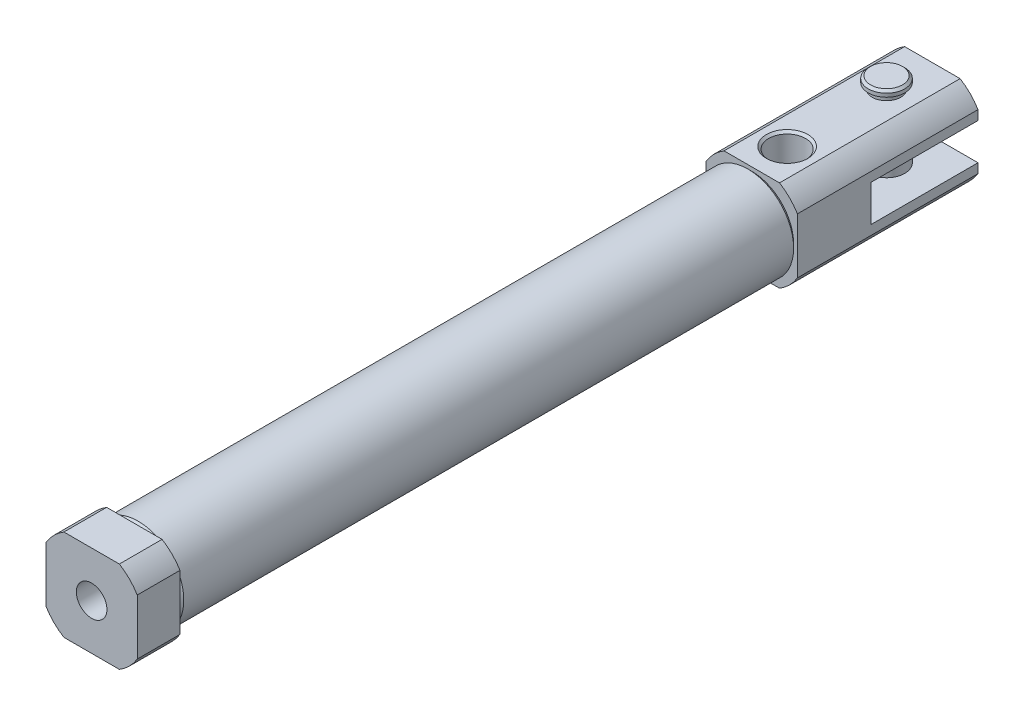
ISO-10303-21;
HEADER;
FILE_DESCRIPTION(('STEP AP214'),'2;1');
FILE_NAME('part.step','',(''),(''),'','','');
FILE_SCHEMA(('AUTOMOTIVE_DESIGN { 1 0 10303 214 1 1 1 1 }'));
ENDSEC;
DATA;
#1=APPLICATION_CONTEXT('core data for automotive mechanical design processes');
#2=APPLICATION_PROTOCOL_DEFINITION('international standard','automotive_design',2000,#1);
#3=PRODUCT_CONTEXT('',#1,'mechanical');
#4=PRODUCT('Part','Part','',(#3));
#5=PRODUCT_RELATED_PRODUCT_CATEGORY('part','',(#4));
#6=PRODUCT_DEFINITION_FORMATION('','',#4);
#7=PRODUCT_DEFINITION_CONTEXT('part definition',#1,'design');
#8=PRODUCT_DEFINITION('design','',#6,#7);
#9=PRODUCT_DEFINITION_SHAPE('','',#8);
#10=(LENGTH_UNIT() NAMED_UNIT(*) SI_UNIT(.MILLI.,.METRE.));
#11=(NAMED_UNIT(*) PLANE_ANGLE_UNIT() SI_UNIT($,.RADIAN.));
#12=(NAMED_UNIT(*) SI_UNIT($,.STERADIAN.) SOLID_ANGLE_UNIT());
#13=UNCERTAINTY_MEASURE_WITH_UNIT(LENGTH_MEASURE(1.E-05),#10,'distance_accuracy_value','');
#14=(GEOMETRIC_REPRESENTATION_CONTEXT(3) GLOBAL_UNCERTAINTY_ASSIGNED_CONTEXT((#13)) GLOBAL_UNIT_ASSIGNED_CONTEXT((#10,
#11,#12)) REPRESENTATION_CONTEXT('',''));
#15=CARTESIAN_POINT('',(0.,0.,0.));
#16=DIRECTION('',(0.,0.,1.));
#17=DIRECTION('',(1.,0.,0.));
#18=AXIS2_PLACEMENT_3D('',#15,#16,#17);
#19=CARTESIAN_POINT('',(0.,0.,-27.9));
#20=DIRECTION('',(0.,0.,1.));
#21=DIRECTION('',(1.,0.,0.));
#22=AXIS2_PLACEMENT_3D('',#19,#20,#21);
#23=PLANE('',#22);
#24=CARTESIAN_POINT('',(0.,0.,-27.9));
#25=DIRECTION('',(0.,0.,-1.));
#26=DIRECTION('',(-1.,0.,0.));
#27=AXIS2_PLACEMENT_3D('',#24,#25,#26);
#28=CIRCLE('',#27,5.);
#29=CARTESIAN_POINT('',(-5.,0.,-27.9));
#30=VERTEX_POINT('',#29);
#31=EDGE_CURVE('E20',#30,#30,#28,.F.);
#32=ORIENTED_EDGE('',*,*,#31,.T.);
#33=EDGE_LOOP('',(#32));
#34=FACE_BOUND('',#33,.T.);
#35=ADVANCED_FACE('F17',(#34),#23,.T.);
#36=CARTESIAN_POINT('',(0.,-7.493,-58.008));
#37=DIRECTION('',(0.,1.,0.));
#38=DIRECTION('',(0.,0.,1.));
#39=AXIS2_PLACEMENT_3D('',#36,#37,#38);
#40=PLANE('',#39);
#41=CARTESIAN_POINT('',(0.,-7.49299999995401,-58.008));
#42=DIRECTION('',(0.,1.,0.));
#43=DIRECTION('',(0.,0.,1.));
#44=AXIS2_PLACEMENT_3D('',#41,#42,#43);
#45=CIRCLE('',#44,2.08999999998032);
#46=CARTESIAN_POINT('',(0.,-7.49299999995401,-55.9180000000197));
#47=VERTEX_POINT('',#46);
#48=EDGE_CURVE('E204',#47,#47,#45,.T.);
#49=ORIENTED_EDGE('',*,*,#48,.F.);
#50=EDGE_LOOP('',(#49));
#51=FACE_BOUND('',#50,.T.);
#52=ADVANCED_FACE('F646',(#51),#40,.F.);
#53=CARTESIAN_POINT('',(0.,7.493,-58.008));
#54=DIRECTION('',(0.,1.,0.));
#55=DIRECTION('',(0.,0.,1.));
#56=AXIS2_PLACEMENT_3D('',#53,#54,#55);
#57=PLANE('',#56);
#58=CARTESIAN_POINT('',(0.,7.49299999995401,-58.008));
#59=DIRECTION('',(0.,-1.,0.));
#60=DIRECTION('',(0.,0.,-1.));
#61=AXIS2_PLACEMENT_3D('',#58,#59,#60);
#62=CIRCLE('',#61,2.09000000003907);
#63=CARTESIAN_POINT('',(0.,7.49299999995401,-60.0980000000391));
#64=VERTEX_POINT('',#63);
#65=EDGE_CURVE('E202',#64,#64,#62,.T.);
#66=ORIENTED_EDGE('',*,*,#65,.F.);
#67=EDGE_LOOP('',(#66));
#68=FACE_BOUND('',#67,.T.);
#69=ADVANCED_FACE('F216',(#68),#57,.T.);
#70=CARTESIAN_POINT('',(0.,0.,42.0421356237309));
#71=DIRECTION('',(0.,0.,-1.));
#72=DIRECTION('',(-1.,0.,0.));
#73=AXIS2_PLACEMENT_3D('',#70,#71,#72);
#74=CYLINDRICAL_SURFACE('',#73,5.);
#75=ORIENTED_EDGE('',*,*,#31,.F.);
#76=EDGE_LOOP('',(#75));
#77=FACE_BOUND('',#76,.T.);
#78=CARTESIAN_POINT('',(0.,0.,27.9));
#79=DIRECTION('',(0.,0.,-1.));
#80=DIRECTION('',(-1.,0.,0.));
#81=AXIS2_PLACEMENT_3D('',#78,#79,#80);
#82=CIRCLE('',#81,5.);
#83=CARTESIAN_POINT('',(-5.,0.,27.9));
#84=VERTEX_POINT('',#83);
#85=EDGE_CURVE('E198',#84,#84,#82,.F.);
#86=ORIENTED_EDGE('',*,*,#85,.T.);
#87=EDGE_LOOP('',(#86));
#88=FACE_BOUND('',#87,.T.);
#89=ADVANCED_FACE('F212',(#77,#88),#74,.F.);
#90=CARTESIAN_POINT('',(0.,-7.19300000008616,-58.008));
#91=DIRECTION('',(0.,1.,0.));
#92=DIRECTION('',(0.,0.,1.));
#93=AXIS2_PLACEMENT_3D('',#90,#91,#92);
#94=CONICAL_SURFACE('',#93,2.38999999984817,0.785398163397448);
#95=CARTESIAN_POINT('',(0.,-7.193,-58.008));
#96=DIRECTION('',(0.,-1.,0.));
#97=DIRECTION('',(0.,0.,-1.));
#98=AXIS2_PLACEMENT_3D('',#95,#96,#97);
#99=CIRCLE('',#98,2.39);
#100=CARTESIAN_POINT('',(0.,-7.193,-60.398));
#101=VERTEX_POINT('',#100);
#102=EDGE_CURVE('E201',#101,#101,#99,.F.);
#103=ORIENTED_EDGE('',*,*,#102,.F.);
#104=EDGE_LOOP('',(#103));
#105=FACE_BOUND('',#104,.T.);
#106=ORIENTED_EDGE('',*,*,#48,.T.);
#107=EDGE_LOOP('',(#106));
#108=FACE_BOUND('',#107,.T.);
#109=ADVANCED_FACE('F215',(#105,#108),#94,.T.);
#110=CARTESIAN_POINT('',(0.,7.19300000002931,-58.008));
#111=DIRECTION('',(0.,-1.,0.));
#112=DIRECTION('',(0.,0.,-1.));
#113=AXIS2_PLACEMENT_3D('',#110,#111,#112);
#114=CONICAL_SURFACE('',#113,2.3900000000206,0.785398163492187);
#115=CARTESIAN_POINT('',(0.,7.193,-58.008));
#116=DIRECTION('',(0.,-1.,0.));
#117=DIRECTION('',(0.,0.,-1.));
#118=AXIS2_PLACEMENT_3D('',#115,#116,#117);
#119=CIRCLE('',#118,2.39);
#120=CARTESIAN_POINT('',(0.,7.193,-60.398));
#121=VERTEX_POINT('',#120);
#122=EDGE_CURVE('E197',#121,#121,#119,.T.);
#123=ORIENTED_EDGE('',*,*,#122,.F.);
#124=EDGE_LOOP('',(#123));
#125=FACE_BOUND('',#124,.T.);
#126=ORIENTED_EDGE('',*,*,#65,.T.);
#127=EDGE_LOOP('',(#126));
#128=FACE_BOUND('',#127,.T.);
#129=ADVANCED_FACE('F224',(#125,#128),#114,.T.);
#130=CARTESIAN_POINT('',(0.,0.,27.9));
#131=DIRECTION('',(0.,0.,1.));
#132=DIRECTION('',(1.,0.,0.));
#133=AXIS2_PLACEMENT_3D('',#130,#131,#132);
#134=PLANE('',#133);
#135=ORIENTED_EDGE('',*,*,#85,.F.);
#136=EDGE_LOOP('',(#135));
#137=FACE_BOUND('',#136,.T.);
#138=CARTESIAN_POINT('',(0.,0.,27.9));
#139=DIRECTION('',(0.,0.,-1.));
#140=DIRECTION('',(-1.,0.,0.));
#141=AXIS2_PLACEMENT_3D('',#138,#139,#140);
#142=CIRCLE('',#141,2.);
#143=CARTESIAN_POINT('',(-2.,0.,27.9));
#144=VERTEX_POINT('',#143);
#145=EDGE_CURVE('E194',#144,#144,#142,.F.);
#146=ORIENTED_EDGE('',*,*,#145,.T.);
#147=EDGE_LOOP('',(#146));
#148=FACE_BOUND('',#147,.T.);
#149=ADVANCED_FACE('F220',(#137,#148),#134,.F.);
#150=CARTESIAN_POINT('',(0.,7.493,-58.008));
#151=DIRECTION('',(0.,-1.,0.));
#152=DIRECTION('',(0.,0.,-1.));
#153=AXIS2_PLACEMENT_3D('',#150,#151,#152);
#154=CYLINDRICAL_SURFACE('',#153,2.39);
#155=ORIENTED_EDGE('',*,*,#102,.T.);
#156=EDGE_LOOP('',(#155));
#157=FACE_BOUND('',#156,.T.);
#158=CARTESIAN_POINT('',(0.,-6.731,-58.008));
#159=DIRECTION('',(0.,-1.,0.));
#160=DIRECTION('',(0.,0.,-1.));
#161=AXIS2_PLACEMENT_3D('',#158,#159,#160);
#162=CIRCLE('',#161,2.39);
#163=CARTESIAN_POINT('',(0.,-6.731,-60.398));
#164=VERTEX_POINT('',#163);
#165=EDGE_CURVE('E191',#164,#164,#162,.T.);
#166=ORIENTED_EDGE('',*,*,#165,.T.);
#167=EDGE_LOOP('',(#166));
#168=FACE_BOUND('',#167,.T.);
#169=ADVANCED_FACE('F223',(#157,#168),#154,.T.);
#170=CARTESIAN_POINT('',(0.,0.,-45.008));
#171=DIRECTION('',(0.,-1.,0.));
#172=DIRECTION('',(0.,0.,-1.));
#173=AXIS2_PLACEMENT_3D('',#170,#171,#172);
#174=PLANE('',#173);
#175=CARTESIAN_POINT('',(0.,0.,-45.008));
#176=DIRECTION('',(0.,-1.,0.));
#177=DIRECTION('',(0.,0.,-1.));
#178=AXIS2_PLACEMENT_3D('',#175,#176,#177);
#179=CIRCLE('',#178,2.41500000000001);
#180=CARTESIAN_POINT('',(0.,0.,-47.423));
#181=VERTEX_POINT('',#180);
#182=EDGE_CURVE('E188',#181,#181,#179,.F.);
#183=ORIENTED_EDGE('',*,*,#182,.T.);
#184=EDGE_LOOP('',(#183));
#185=FACE_BOUND('',#184,.T.);
#186=ADVANCED_FACE('F242',(#185),#174,.F.);
#187=CARTESIAN_POINT('',(0.,7.493,-58.008));
#188=DIRECTION('',(0.,-1.,0.));
#189=DIRECTION('',(0.,0.,-1.));
#190=AXIS2_PLACEMENT_3D('',#187,#188,#189);
#191=CYLINDRICAL_SURFACE('',#190,2.39);
#192=CARTESIAN_POINT('',(0.,6.731,-58.008));
#193=DIRECTION('',(0.,-1.,0.));
#194=DIRECTION('',(0.,0.,-1.));
#195=AXIS2_PLACEMENT_3D('',#192,#193,#194);
#196=CIRCLE('',#195,2.39);
#197=CARTESIAN_POINT('',(0.,6.731,-60.398));
#198=VERTEX_POINT('',#197);
#199=EDGE_CURVE('E185',#198,#198,#196,.F.);
#200=ORIENTED_EDGE('',*,*,#199,.T.);
#201=EDGE_LOOP('',(#200));
#202=FACE_BOUND('',#201,.T.);
#203=ORIENTED_EDGE('',*,*,#122,.T.);
#204=EDGE_LOOP('',(#203));
#205=FACE_BOUND('',#204,.T.);
#206=ADVANCED_FACE('F231',(#202,#205),#191,.T.);
#207=CARTESIAN_POINT('',(0.,0.,45.974));
#208=DIRECTION('',(0.,0.,-1.));
#209=DIRECTION('',(-1.,0.,0.));
#210=AXIS2_PLACEMENT_3D('',#207,#208,#209);
#211=CYLINDRICAL_SURFACE('',#210,2.);
#212=CARTESIAN_POINT('',(0.,0.,45.974));
#213=DIRECTION('',(0.,0.,-1.));
#214=DIRECTION('',(-1.,0.,0.));
#215=AXIS2_PLACEMENT_3D('',#212,#213,#214);
#216=CIRCLE('',#215,2.);
#217=CARTESIAN_POINT('',(-2.,0.,45.974));
#218=VERTEX_POINT('',#217);
#219=EDGE_CURVE('E182',#218,#218,#216,.T.);
#220=ORIENTED_EDGE('',*,*,#219,.F.);
#221=EDGE_LOOP('',(#220));
#222=FACE_BOUND('',#221,.T.);
#223=ORIENTED_EDGE('',*,*,#145,.F.);
#224=EDGE_LOOP('',(#223));
#225=FACE_BOUND('',#224,.T.);
#226=ADVANCED_FACE('F228',(#222,#225),#211,.F.);
#227=CARTESIAN_POINT('',(0.,-6.731,-60.398));
#228=DIRECTION('',(0.,-1.,0.));
#229=DIRECTION('',(0.,0.,-1.));
#230=AXIS2_PLACEMENT_3D('',#227,#228,#229);
#231=PLANE('',#230);
#232=CARTESIAN_POINT('',(0.,-6.731,-58.008));
#233=DIRECTION('',(0.,-1.,0.));
#234=DIRECTION('',(0.,0.,-1.));
#235=AXIS2_PLACEMENT_3D('',#232,#233,#234);
#236=CIRCLE('',#235,1.8669);
#237=CARTESIAN_POINT('',(0.,-6.731,-59.8749));
#238=VERTEX_POINT('',#237);
#239=EDGE_CURVE('E179',#238,#238,#236,.F.);
#240=ORIENTED_EDGE('',*,*,#239,.F.);
#241=EDGE_LOOP('',(#240));
#242=FACE_BOUND('',#241,.T.);
#243=ORIENTED_EDGE('',*,*,#165,.F.);
#244=EDGE_LOOP('',(#243));
#245=FACE_BOUND('',#244,.T.);
#246=ADVANCED_FACE('F230',(#242,#245),#231,.F.);
#247=CARTESIAN_POINT('',(0.,0.,-45.008));
#248=DIRECTION('',(0.,-1.,0.));
#249=DIRECTION('',(0.,0.,-1.));
#250=AXIS2_PLACEMENT_3D('',#247,#248,#249);
#251=CYLINDRICAL_SURFACE('',#250,2.41500000000001);
#252=ORIENTED_EDGE('',*,*,#182,.F.);
#253=EDGE_LOOP('',(#252));
#254=FACE_BOUND('',#253,.T.);
#255=CARTESIAN_POINT('',(0.,5.66900000001169,-45.008));
#256=DIRECTION('',(0.,1.,0.));
#257=DIRECTION('',(0.,0.,1.));
#258=AXIS2_PLACEMENT_3D('',#255,#256,#257);
#259=CIRCLE('',#258,2.4149999999324);
#260=CARTESIAN_POINT('',(0.,5.66900000001169,-42.5930000000676));
#261=VERTEX_POINT('',#260);
#262=EDGE_CURVE('E178',#261,#261,#259,.T.);
#263=ORIENTED_EDGE('',*,*,#262,.T.);
#264=EDGE_LOOP('',(#263));
#265=FACE_BOUND('',#264,.T.);
#266=ADVANCED_FACE('F239',(#254,#265),#251,.F.);
#267=CARTESIAN_POINT('',(0.,6.731,-60.398));
#268=DIRECTION('',(0.,1.,0.));
#269=DIRECTION('',(0.,0.,1.));
#270=AXIS2_PLACEMENT_3D('',#267,#268,#269);
#271=PLANE('',#270);
#272=ORIENTED_EDGE('',*,*,#199,.F.);
#273=EDGE_LOOP('',(#272));
#274=FACE_BOUND('',#273,.T.);
#275=CARTESIAN_POINT('',(0.,6.731,-58.008));
#276=DIRECTION('',(0.,-1.,0.));
#277=DIRECTION('',(0.,0.,-1.));
#278=AXIS2_PLACEMENT_3D('',#275,#276,#277);
#279=CIRCLE('',#278,1.8669);
#280=CARTESIAN_POINT('',(0.,6.731,-59.8749));
#281=VERTEX_POINT('',#280);
#282=EDGE_CURVE('E174',#281,#281,#279,.T.);
#283=ORIENTED_EDGE('',*,*,#282,.F.);
#284=EDGE_LOOP('',(#283));
#285=FACE_BOUND('',#284,.T.);
#286=ADVANCED_FACE('F367',(#274,#285),#271,.F.);
#287=CARTESIAN_POINT('',(0.,7.493,-58.008));
#288=DIRECTION('',(0.,-1.,0.));
#289=DIRECTION('',(0.,0.,-1.));
#290=AXIS2_PLACEMENT_3D('',#287,#288,#289);
#291=CYLINDRICAL_SURFACE('',#290,2.39);
#292=CARTESIAN_POINT('',(0.,2.39,-58.008));
#293=DIRECTION('',(0.,-1.,0.));
#294=DIRECTION('',(0.,0.,-1.));
#295=AXIS2_PLACEMENT_3D('',#292,#293,#294);
#296=CIRCLE('',#295,2.39);
#297=CARTESIAN_POINT('',(0.,2.39,-60.398));
#298=VERTEX_POINT('',#297);
#299=EDGE_CURVE('E169',#298,#298,#296,.T.);
#300=ORIENTED_EDGE('',*,*,#299,.T.);
#301=EDGE_LOOP('',(#300));
#302=FACE_BOUND('',#301,.T.);
#303=CARTESIAN_POINT('',(0.,-2.39,-58.008));
#304=DIRECTION('',(0.,-1.,0.));
#305=DIRECTION('',(0.,0.,-1.));
#306=AXIS2_PLACEMENT_3D('',#303,#304,#305);
#307=CIRCLE('',#306,2.39);
#308=CARTESIAN_POINT('',(0.,-2.39,-60.398));
#309=VERTEX_POINT('',#308);
#310=EDGE_CURVE('E165',#309,#309,#307,.F.);
#311=ORIENTED_EDGE('',*,*,#310,.T.);
#312=EDGE_LOOP('',(#311));
#313=FACE_BOUND('',#312,.T.);
#314=ADVANCED_FACE('F363',(#302,#313),#291,.T.);
#315=CARTESIAN_POINT('',(0.,0.,45.974));
#316=DIRECTION('',(0.,0.,1.));
#317=DIRECTION('',(1.,0.,0.));
#318=AXIS2_PLACEMENT_3D('',#315,#316,#317);
#319=PLANE('',#318);
#320=ORIENTED_EDGE('',*,*,#219,.T.);
#321=EDGE_LOOP('',(#320));
#322=FACE_BOUND('',#321,.T.);
#323=CARTESIAN_POINT('',(0.,0.,45.974));
#324=DIRECTION('',(0.,0.,-1.));
#325=DIRECTION('',(-1.,0.,0.));
#326=AXIS2_PLACEMENT_3D('',#323,#324,#325);
#327=CIRCLE('',#326,6.985);
#328=CARTESIAN_POINT('',(-5.969,3.62784564169977,45.974));
#329=VERTEX_POINT('',#328);
#330=CARTESIAN_POINT('',(-3.62784564169977,5.969,45.974));
#331=VERTEX_POINT('',#330);
#332=EDGE_CURVE('E451',#329,#331,#327,.T.);
#333=ORIENTED_EDGE('',*,*,#332,.F.);
#334=DIRECTION('',(0.,1.,0.));
#335=VECTOR('',#334,1.);
#336=CARTESIAN_POINT('',(-5.969,3.62784564169977,45.974));
#337=LINE('',#336,#335);
#338=CARTESIAN_POINT('',(-5.969,-3.62784564169977,45.974));
#339=VERTEX_POINT('',#338);
#340=EDGE_CURVE('E466',#329,#339,#337,.F.);
#341=ORIENTED_EDGE('',*,*,#340,.T.);
#342=CARTESIAN_POINT('',(0.,0.,45.974));
#343=DIRECTION('',(0.,0.,-1.));
#344=DIRECTION('',(-1.,0.,0.));
#345=AXIS2_PLACEMENT_3D('',#342,#343,#344);
#346=CIRCLE('',#345,6.985);
#347=CARTESIAN_POINT('',(-3.62784564169977,-5.969,45.974));
#348=VERTEX_POINT('',#347);
#349=EDGE_CURVE('E143',#348,#339,#346,.T.);
#350=ORIENTED_EDGE('',*,*,#349,.F.);
#351=DIRECTION('',(1.,0.,0.));
#352=VECTOR('',#351,1.);
#353=CARTESIAN_POINT('',(-3.62784564169977,-5.969,45.974));
#354=LINE('',#353,#352);
#355=CARTESIAN_POINT('',(3.62784564169977,-5.969,45.974));
#356=VERTEX_POINT('',#355);
#357=EDGE_CURVE('E139',#348,#356,#354,.T.);
#358=ORIENTED_EDGE('',*,*,#357,.T.);
#359=CARTESIAN_POINT('',(0.,0.,45.974));
#360=DIRECTION('',(0.,0.,-1.));
#361=DIRECTION('',(-1.,0.,0.));
#362=AXIS2_PLACEMENT_3D('',#359,#360,#361);
#363=CIRCLE('',#362,6.985);
#364=CARTESIAN_POINT('',(5.969,-3.62784564169977,45.974));
#365=VERTEX_POINT('',#364);
#366=EDGE_CURVE('E136',#365,#356,#363,.T.);
#367=ORIENTED_EDGE('',*,*,#366,.F.);
#368=DIRECTION('',(0.,1.,0.));
#369=VECTOR('',#368,1.);
#370=CARTESIAN_POINT('',(5.969,3.62784564169977,45.974));
#371=LINE('',#370,#369);
#372=CARTESIAN_POINT('',(5.969,3.62784564169977,45.974));
#373=VERTEX_POINT('',#372);
#374=EDGE_CURVE('E384',#365,#373,#371,.T.);
#375=ORIENTED_EDGE('',*,*,#374,.T.);
#376=CARTESIAN_POINT('',(0.,0.,45.974));
#377=DIRECTION('',(0.,0.,-1.));
#378=DIRECTION('',(-1.,0.,0.));
#379=AXIS2_PLACEMENT_3D('',#376,#377,#378);
#380=CIRCLE('',#379,6.985);
#381=CARTESIAN_POINT('',(3.62784564169977,5.969,45.974));
#382=VERTEX_POINT('',#381);
#383=EDGE_CURVE('E163',#382,#373,#380,.T.);
#384=ORIENTED_EDGE('',*,*,#383,.F.);
#385=DIRECTION('',(1.,0.,0.));
#386=VECTOR('',#385,1.);
#387=CARTESIAN_POINT('',(-3.62784564169977,5.969,45.974));
#388=LINE('',#387,#386);
#389=EDGE_CURVE('E454',#382,#331,#388,.F.);
#390=ORIENTED_EDGE('',*,*,#389,.T.);
#391=EDGE_LOOP('',(#333,#341,#350,#358,#367,#375,#384,#390));
#392=FACE_BOUND('',#391,.T.);
#393=ADVANCED_FACE('F141',(#322,#392),#319,.T.);
#394=CARTESIAN_POINT('',(0.,0.,-58.008));
#395=DIRECTION('',(0.,-1.,0.));
#396=DIRECTION('',(0.,0.,-1.));
#397=AXIS2_PLACEMENT_3D('',#394,#395,#396);
#398=CYLINDRICAL_SURFACE('',#397,1.8669);
#399=ORIENTED_EDGE('',*,*,#239,.T.);
#400=EDGE_LOOP('',(#399));
#401=FACE_BOUND('',#400,.T.);
#402=CARTESIAN_POINT('',(0.,-5.969,-58.008));
#403=DIRECTION('',(0.,-1.,0.));
#404=DIRECTION('',(0.,0.,-1.));
#405=AXIS2_PLACEMENT_3D('',#402,#403,#404);
#406=CIRCLE('',#405,1.8669);
#407=CARTESIAN_POINT('',(0.,-5.969,-59.8749));
#408=VERTEX_POINT('',#407);
#409=EDGE_CURVE('E445',#408,#408,#406,.T.);
#410=ORIENTED_EDGE('',*,*,#409,.T.);
#411=EDGE_LOOP('',(#410));
#412=FACE_BOUND('',#411,.T.);
#413=ADVANCED_FACE('F356',(#401,#412),#398,.T.);
#414=CARTESIAN_POINT('',(0.,5.96900000005007,-45.008));
#415=DIRECTION('',(0.,1.,0.));
#416=DIRECTION('',(0.,0.,1.));
#417=AXIS2_PLACEMENT_3D('',#414,#415,#416);
#418=CONICAL_SURFACE('',#417,2.71500000002762,0.785398163397448);
#419=CARTESIAN_POINT('',(0.,5.96900000005007,-45.008));
#420=DIRECTION('',(0.,1.,0.));
#421=DIRECTION('',(0.,0.,1.));
#422=AXIS2_PLACEMENT_3D('',#419,#420,#421);
#423=CIRCLE('',#422,2.71500000002762);
#424=CARTESIAN_POINT('',(0.,5.96900000005007,-42.2929999999724));
#425=VERTEX_POINT('',#424);
#426=EDGE_CURVE('E432',#425,#425,#423,.T.);
#427=ORIENTED_EDGE('',*,*,#426,.T.);
#428=EDGE_LOOP('',(#427));
#429=FACE_BOUND('',#428,.T.);
#430=ORIENTED_EDGE('',*,*,#262,.F.);
#431=EDGE_LOOP('',(#430));
#432=FACE_BOUND('',#431,.T.);
#433=ADVANCED_FACE('F352',(#429,#432),#418,.F.);
#434=CARTESIAN_POINT('',(0.,0.,-58.008));
#435=DIRECTION('',(0.,-1.,0.));
#436=DIRECTION('',(0.,0.,-1.));
#437=AXIS2_PLACEMENT_3D('',#434,#435,#436);
#438=CYLINDRICAL_SURFACE('',#437,1.8669);
#439=CARTESIAN_POINT('',(0.,5.969,-58.008));
#440=DIRECTION('',(0.,-1.,0.));
#441=DIRECTION('',(0.,0.,-1.));
#442=AXIS2_PLACEMENT_3D('',#439,#440,#441);
#443=CIRCLE('',#442,1.8669);
#444=CARTESIAN_POINT('',(0.,5.969,-59.8749));
#445=VERTEX_POINT('',#444);
#446=EDGE_CURVE('E429',#445,#445,#443,.F.);
#447=ORIENTED_EDGE('',*,*,#446,.T.);
#448=EDGE_LOOP('',(#447));
#449=FACE_BOUND('',#448,.T.);
#450=ORIENTED_EDGE('',*,*,#282,.T.);
#451=EDGE_LOOP('',(#450));
#452=FACE_BOUND('',#451,.T.);
#453=ADVANCED_FACE('F348',(#449,#452),#438,.T.);
#454=CARTESIAN_POINT('',(0.,0.,-64.008));
#455=DIRECTION('',(0.,0.,-1.));
#456=DIRECTION('',(-1.,0.,0.));
#457=AXIS2_PLACEMENT_3D('',#454,#455,#456);
#458=PLANE('',#457);
#459=CARTESIAN_POINT('',(0.,0.,-64.008));
#460=DIRECTION('',(0.,0.,1.));
#461=DIRECTION('',(1.,0.,0.));
#462=AXIS2_PLACEMENT_3D('',#459,#460,#461);
#463=CIRCLE('',#462,6.985);
#464=CARTESIAN_POINT('',(5.969,3.62784564169977,-64.008));
#465=VERTEX_POINT('',#464);
#466=CARTESIAN_POINT('',(3.62784564169977,5.969,-64.008));
#467=VERTEX_POINT('',#466);
#468=EDGE_CURVE('E425',#465,#467,#463,.T.);
#469=ORIENTED_EDGE('',*,*,#468,.F.);
#470=DIRECTION('',(0.,1.,0.));
#471=VECTOR('',#470,1.);
#472=CARTESIAN_POINT('',(5.969,0.,-64.008));
#473=LINE('',#472,#471);
#474=CARTESIAN_POINT('',(5.969,2.39,-64.008));
#475=VERTEX_POINT('',#474);
#476=EDGE_CURVE('E177',#465,#475,#473,.F.);
#477=ORIENTED_EDGE('',*,*,#476,.T.);
#478=DIRECTION('',(1.,0.,0.));
#479=VECTOR('',#478,1.);
#480=CARTESIAN_POINT('',(-5.97,2.39,-64.008));
#481=LINE('',#480,#479);
#482=CARTESIAN_POINT('',(-5.969,2.39,-64.008));
#483=VERTEX_POINT('',#482);
#484=EDGE_CURVE('E173',#475,#483,#481,.F.);
#485=ORIENTED_EDGE('',*,*,#484,.T.);
#486=DIRECTION('',(0.,1.,0.));
#487=VECTOR('',#486,1.);
#488=CARTESIAN_POINT('',(-5.969,3.62784564169977,-64.008));
#489=LINE('',#488,#487);
#490=CARTESIAN_POINT('',(-5.969,3.62784564169977,-64.008));
#491=VERTEX_POINT('',#490);
#492=EDGE_CURVE('E478',#483,#491,#489,.T.);
#493=ORIENTED_EDGE('',*,*,#492,.T.);
#494=CARTESIAN_POINT('',(0.,0.,-64.008));
#495=DIRECTION('',(0.,0.,1.));
#496=DIRECTION('',(1.,0.,0.));
#497=AXIS2_PLACEMENT_3D('',#494,#495,#496);
#498=CIRCLE('',#497,6.985);
#499=CARTESIAN_POINT('',(-3.62784564169977,5.969,-64.008));
#500=VERTEX_POINT('',#499);
#501=EDGE_CURVE('E436',#500,#491,#498,.T.);
#502=ORIENTED_EDGE('',*,*,#501,.F.);
#503=DIRECTION('',(1.,0.,0.));
#504=VECTOR('',#503,1.);
#505=CARTESIAN_POINT('',(3.62784564169977,5.969,-64.008));
#506=LINE('',#505,#504);
#507=EDGE_CURVE('E435',#500,#467,#506,.T.);
#508=ORIENTED_EDGE('',*,*,#507,.T.);
#509=EDGE_LOOP('',(#469,#477,#485,#493,#502,#508));
#510=FACE_BOUND('',#509,.T.);
#511=ADVANCED_FACE('F344',(#510),#458,.T.);
#512=CARTESIAN_POINT('',(-5.97,2.39,-64.008));
#513=DIRECTION('',(0.,1.,0.));
#514=DIRECTION('',(0.,0.,1.));
#515=AXIS2_PLACEMENT_3D('',#512,#513,#514);
#516=PLANE('',#515);
#517=ORIENTED_EDGE('',*,*,#299,.F.);
#518=EDGE_LOOP('',(#517));
#519=FACE_BOUND('',#518,.T.);
#520=DIRECTION('',(0.,0.,1.));
#521=VECTOR('',#520,1.);
#522=CARTESIAN_POINT('',(5.969,2.39,-64.008));
#523=LINE('',#522,#521);
#524=CARTESIAN_POINT('',(5.969,2.39,-50.008));
#525=VERTEX_POINT('',#524);
#526=EDGE_CURVE('E504',#475,#525,#523,.T.);
#527=ORIENTED_EDGE('',*,*,#526,.T.);
#528=DIRECTION('',(1.,0.,0.));
#529=VECTOR('',#528,1.);
#530=CARTESIAN_POINT('',(-5.97,2.39,-50.008));
#531=LINE('',#530,#529);
#532=CARTESIAN_POINT('',(-5.969,2.39,-50.008));
#533=VERTEX_POINT('',#532);
#534=EDGE_CURVE('E172',#525,#533,#531,.F.);
#535=ORIENTED_EDGE('',*,*,#534,.T.);
#536=DIRECTION('',(0.,0.,1.));
#537=VECTOR('',#536,1.);
#538=CARTESIAN_POINT('',(-5.969,2.39,-64.008));
#539=LINE('',#538,#537);
#540=EDGE_CURVE('E475',#533,#483,#539,.F.);
#541=ORIENTED_EDGE('',*,*,#540,.T.);
#542=ORIENTED_EDGE('',*,*,#484,.F.);
#543=EDGE_LOOP('',(#527,#535,#541,#542));
#544=FACE_BOUND('',#543,.T.);
#545=ADVANCED_FACE('F340',(#519,#544),#516,.F.);
#546=CARTESIAN_POINT('',(-5.97,2.39,-50.008));
#547=DIRECTION('',(0.,0.,1.));
#548=DIRECTION('',(1.,0.,0.));
#549=AXIS2_PLACEMENT_3D('',#546,#547,#548);
#550=PLANE('',#549);
#551=DIRECTION('',(0.,-1.,0.));
#552=VECTOR('',#551,1.);
#553=CARTESIAN_POINT('',(5.969,3.62784564169977,-50.008));
#554=LINE('',#553,#552);
#555=CARTESIAN_POINT('',(5.969,-2.39,-50.008));
#556=VERTEX_POINT('',#555);
#557=EDGE_CURVE('E507',#525,#556,#554,.T.);
#558=ORIENTED_EDGE('',*,*,#557,.T.);
#559=DIRECTION('',(1.,0.,0.));
#560=VECTOR('',#559,1.);
#561=CARTESIAN_POINT('',(-5.97,-2.39,-50.008));
#562=LINE('',#561,#560);
#563=CARTESIAN_POINT('',(-5.969,-2.39,-50.008));
#564=VERTEX_POINT('',#563);
#565=EDGE_CURVE('E168',#556,#564,#562,.F.);
#566=ORIENTED_EDGE('',*,*,#565,.T.);
#567=DIRECTION('',(0.,1.,0.));
#568=VECTOR('',#567,1.);
#569=CARTESIAN_POINT('',(-5.969,3.62784564169977,-50.008));
#570=LINE('',#569,#568);
#571=EDGE_CURVE('E440',#564,#533,#570,.T.);
#572=ORIENTED_EDGE('',*,*,#571,.T.);
#573=ORIENTED_EDGE('',*,*,#534,.F.);
#574=EDGE_LOOP('',(#558,#566,#572,#573));
#575=FACE_BOUND('',#574,.T.);
#576=ADVANCED_FACE('F336',(#575),#550,.F.);
#577=CARTESIAN_POINT('',(-5.97,-2.39,-64.008));
#578=DIRECTION('',(0.,-1.,0.));
#579=DIRECTION('',(0.,0.,-1.));
#580=AXIS2_PLACEMENT_3D('',#577,#578,#579);
#581=PLANE('',#580);
#582=ORIENTED_EDGE('',*,*,#310,.F.);
#583=EDGE_LOOP('',(#582));
#584=FACE_BOUND('',#583,.T.);
#585=DIRECTION('',(0.,0.,1.));
#586=VECTOR('',#585,1.);
#587=CARTESIAN_POINT('',(5.969,-2.39,-64.008));
#588=LINE('',#587,#586);
#589=CARTESIAN_POINT('',(5.969,-2.39,-64.008));
#590=VERTEX_POINT('',#589);
#591=EDGE_CURVE('E517',#556,#590,#588,.F.);
#592=ORIENTED_EDGE('',*,*,#591,.T.);
#593=DIRECTION('',(-1.,0.,0.));
#594=VECTOR('',#593,1.);
#595=CARTESIAN_POINT('',(0.,-2.39,-64.008));
#596=LINE('',#595,#594);
#597=CARTESIAN_POINT('',(-5.969,-2.39,-64.008));
#598=VERTEX_POINT('',#597);
#599=EDGE_CURVE('E146',#598,#590,#596,.F.);
#600=ORIENTED_EDGE('',*,*,#599,.F.);
#601=DIRECTION('',(0.,0.,1.));
#602=VECTOR('',#601,1.);
#603=CARTESIAN_POINT('',(-5.969,-2.39,-64.008));
#604=LINE('',#603,#602);
#605=EDGE_CURVE('E472',#598,#564,#604,.T.);
#606=ORIENTED_EDGE('',*,*,#605,.T.);
#607=ORIENTED_EDGE('',*,*,#565,.F.);
#608=EDGE_LOOP('',(#592,#600,#606,#607));
#609=FACE_BOUND('',#608,.T.);
#610=ADVANCED_FACE('F332',(#584,#609),#581,.F.);
#611=CARTESIAN_POINT('',(0.,0.,-64.008));
#612=DIRECTION('',(0.,0.,-1.));
#613=DIRECTION('',(-1.,0.,0.));
#614=AXIS2_PLACEMENT_3D('',#611,#612,#613);
#615=PLANE('',#614);
#616=CARTESIAN_POINT('',(0.,0.,-64.008));
#617=DIRECTION('',(0.,0.,1.));
#618=DIRECTION('',(1.,0.,0.));
#619=AXIS2_PLACEMENT_3D('',#616,#617,#618);
#620=CIRCLE('',#619,6.985);
#621=CARTESIAN_POINT('',(-5.969,-3.62784564169977,-64.008));
#622=VERTEX_POINT('',#621);
#623=CARTESIAN_POINT('',(-3.62784564169977,-5.969,-64.008));
#624=VERTEX_POINT('',#623);
#625=EDGE_CURVE('E441',#622,#624,#620,.T.);
#626=ORIENTED_EDGE('',*,*,#625,.F.);
#627=DIRECTION('',(0.,1.,0.));
#628=VECTOR('',#627,1.);
#629=CARTESIAN_POINT('',(-5.969,3.62784564169977,-64.008));
#630=LINE('',#629,#628);
#631=EDGE_CURVE('E483',#622,#598,#630,.T.);
#632=ORIENTED_EDGE('',*,*,#631,.T.);
#633=ORIENTED_EDGE('',*,*,#599,.T.);
#634=DIRECTION('',(0.,-1.,0.));
#635=VECTOR('',#634,1.);
#636=CARTESIAN_POINT('',(5.969,3.62784564169977,-64.008));
#637=LINE('',#636,#635);
#638=CARTESIAN_POINT('',(5.969,-3.62784564169977,-64.008));
#639=VERTEX_POINT('',#638);
#640=EDGE_CURVE('E526',#590,#639,#637,.T.);
#641=ORIENTED_EDGE('',*,*,#640,.T.);
#642=CARTESIAN_POINT('',(0.,0.,-64.008));
#643=DIRECTION('',(0.,0.,1.));
#644=DIRECTION('',(1.,0.,0.));
#645=AXIS2_PLACEMENT_3D('',#642,#643,#644);
#646=CIRCLE('',#645,6.985);
#647=CARTESIAN_POINT('',(3.62784564169977,-5.969,-64.008));
#648=VERTEX_POINT('',#647);
#649=EDGE_CURVE('E420',#648,#639,#646,.T.);
#650=ORIENTED_EDGE('',*,*,#649,.F.);
#651=DIRECTION('',(1.,0.,0.));
#652=VECTOR('',#651,1.);
#653=CARTESIAN_POINT('',(3.62784564169977,-5.969,-64.008));
#654=LINE('',#653,#652);
#655=EDGE_CURVE('E448',#648,#624,#654,.F.);
#656=ORIENTED_EDGE('',*,*,#655,.T.);
#657=EDGE_LOOP('',(#626,#632,#633,#641,#650,#656));
#658=FACE_BOUND('',#657,.T.);
#659=ADVANCED_FACE('F329',(#658),#615,.T.);
#660=CARTESIAN_POINT('',(-3.62784564169977,-5.969,45.974));
#661=DIRECTION('',(0.,1.,0.));
#662=DIRECTION('',(0.,0.,1.));
#663=AXIS2_PLACEMENT_3D('',#660,#661,#662);
#664=PLANE('',#663);
#665=DIRECTION('',(0.,0.,-1.));
#666=VECTOR('',#665,1.);
#667=CARTESIAN_POINT('',(3.62784564169977,-5.969,45.974));
#668=LINE('',#667,#666);
#669=CARTESIAN_POINT('',(3.62784564169977,-5.969,40.386));
#670=VERTEX_POINT('',#669);
#671=EDGE_CURVE('E149',#356,#670,#668,.T.);
#672=ORIENTED_EDGE('',*,*,#671,.F.);
#673=ORIENTED_EDGE('',*,*,#357,.F.);
#674=DIRECTION('',(0.,0.,-1.));
#675=VECTOR('',#674,1.);
#676=CARTESIAN_POINT('',(-3.62784564169977,-5.969,45.974));
#677=LINE('',#676,#675);
#678=CARTESIAN_POINT('',(-3.62784564169977,-5.969,40.386));
#679=VERTEX_POINT('',#678);
#680=EDGE_CURVE('E450',#679,#348,#677,.F.);
#681=ORIENTED_EDGE('',*,*,#680,.F.);
#682=DIRECTION('',(1.,0.,0.));
#683=VECTOR('',#682,1.);
#684=CARTESIAN_POINT('',(0.,-5.969,40.386));
#685=LINE('',#684,#683);
#686=EDGE_CURVE('E152',#679,#670,#685,.T.);
#687=ORIENTED_EDGE('',*,*,#686,.T.);
#688=EDGE_LOOP('',(#672,#673,#681,#687));
#689=FACE_BOUND('',#688,.T.);
#690=ADVANCED_FACE('F150',(#689),#664,.F.);
#691=CARTESIAN_POINT('',(0.,0.,45.974));
#692=DIRECTION('',(0.,0.,-1.));
#693=DIRECTION('',(-1.,0.,0.));
#694=AXIS2_PLACEMENT_3D('',#691,#692,#693);
#695=CYLINDRICAL_SURFACE('',#694,6.985);
#696=ORIENTED_EDGE('',*,*,#366,.T.);
#697=ORIENTED_EDGE('',*,*,#671,.T.);
#698=CARTESIAN_POINT('',(0.,0.,40.386));
#699=DIRECTION('',(0.,0.,-1.));
#700=DIRECTION('',(-1.,0.,0.));
#701=AXIS2_PLACEMENT_3D('',#698,#699,#700);
#702=CIRCLE('',#701,6.985);
#703=CARTESIAN_POINT('',(5.969,-3.62784564169977,40.386));
#704=VERTEX_POINT('',#703);
#705=EDGE_CURVE('E418',#670,#704,#702,.F.);
#706=ORIENTED_EDGE('',*,*,#705,.T.);
#707=DIRECTION('',(0.,0.,1.));
#708=VECTOR('',#707,1.);
#709=CARTESIAN_POINT('',(5.969,-3.62784564169977,45.974));
#710=LINE('',#709,#708);
#711=EDGE_CURVE('E155',#704,#365,#710,.T.);
#712=ORIENTED_EDGE('',*,*,#711,.T.);
#713=EDGE_LOOP('',(#696,#697,#706,#712));
#714=FACE_BOUND('',#713,.T.);
#715=ADVANCED_FACE('F157',(#714),#695,.T.);
#716=CARTESIAN_POINT('',(5.969,3.62784564169977,45.974));
#717=DIRECTION('',(-1.,0.,0.));
#718=DIRECTION('',(0.,0.,1.));
#719=AXIS2_PLACEMENT_3D('',#716,#717,#718);
#720=PLANE('',#719);
#721=DIRECTION('',(0.,0.,-1.));
#722=VECTOR('',#721,1.);
#723=CARTESIAN_POINT('',(5.969,3.62784564169977,45.974));
#724=LINE('',#723,#722);
#725=CARTESIAN_POINT('',(5.969,3.62784564169977,40.386));
#726=VERTEX_POINT('',#725);
#727=EDGE_CURVE('E463',#373,#726,#724,.T.);
#728=ORIENTED_EDGE('',*,*,#727,.F.);
#729=ORIENTED_EDGE('',*,*,#374,.F.);
#730=ORIENTED_EDGE('',*,*,#711,.F.);
#731=DIRECTION('',(0.,1.,0.));
#732=VECTOR('',#731,1.);
#733=CARTESIAN_POINT('',(5.969,0.,40.386));
#734=LINE('',#733,#732);
#735=EDGE_CURVE('E417',#704,#726,#734,.T.);
#736=ORIENTED_EDGE('',*,*,#735,.T.);
#737=EDGE_LOOP('',(#728,#729,#730,#736));
#738=FACE_BOUND('',#737,.T.);
#739=ADVANCED_FACE('F320',(#738),#720,.F.);
#740=CARTESIAN_POINT('',(0.,0.,45.974));
#741=DIRECTION('',(0.,0.,-1.));
#742=DIRECTION('',(-1.,0.,0.));
#743=AXIS2_PLACEMENT_3D('',#740,#741,#742);
#744=CYLINDRICAL_SURFACE('',#743,6.985);
#745=ORIENTED_EDGE('',*,*,#383,.T.);
#746=ORIENTED_EDGE('',*,*,#727,.T.);
#747=CARTESIAN_POINT('',(0.,0.,40.386));
#748=DIRECTION('',(0.,0.,-1.));
#749=DIRECTION('',(-1.,0.,0.));
#750=AXIS2_PLACEMENT_3D('',#747,#748,#749);
#751=CIRCLE('',#750,6.985);
#752=CARTESIAN_POINT('',(3.62784564169977,5.969,40.386));
#753=VERTEX_POINT('',#752);
#754=EDGE_CURVE('E415',#726,#753,#751,.F.);
#755=ORIENTED_EDGE('',*,*,#754,.T.);
#756=DIRECTION('',(0.,0.,-1.));
#757=VECTOR('',#756,1.);
#758=CARTESIAN_POINT('',(3.62784564169977,5.969,45.974));
#759=LINE('',#758,#757);
#760=EDGE_CURVE('E459',#753,#382,#759,.F.);
#761=ORIENTED_EDGE('',*,*,#760,.T.);
#762=EDGE_LOOP('',(#745,#746,#755,#761));
#763=FACE_BOUND('',#762,.T.);
#764=ADVANCED_FACE('F316',(#763),#744,.T.);
#765=CARTESIAN_POINT('',(-3.62784564169977,5.969,45.974));
#766=DIRECTION('',(0.,-1.,0.));
#767=DIRECTION('',(0.,0.,-1.));
#768=AXIS2_PLACEMENT_3D('',#765,#766,#767);
#769=PLANE('',#768);
#770=DIRECTION('',(0.,0.,-1.));
#771=VECTOR('',#770,1.);
#772=CARTESIAN_POINT('',(-3.62784564169977,5.969,45.974));
#773=LINE('',#772,#771);
#774=CARTESIAN_POINT('',(-3.62784564169977,5.969,40.386));
#775=VERTEX_POINT('',#774);
#776=EDGE_CURVE('E453',#331,#775,#773,.T.);
#777=ORIENTED_EDGE('',*,*,#776,.F.);
#778=ORIENTED_EDGE('',*,*,#389,.F.);
#779=ORIENTED_EDGE('',*,*,#760,.F.);
#780=DIRECTION('',(1.,0.,0.));
#781=VECTOR('',#780,1.);
#782=CARTESIAN_POINT('',(0.,5.969,40.386));
#783=LINE('',#782,#781);
#784=EDGE_CURVE('E414',#753,#775,#783,.F.);
#785=ORIENTED_EDGE('',*,*,#784,.T.);
#786=EDGE_LOOP('',(#777,#778,#779,#785));
#787=FACE_BOUND('',#786,.T.);
#788=ADVANCED_FACE('F312',(#787),#769,.F.);
#789=CARTESIAN_POINT('',(0.,0.,45.974));
#790=DIRECTION('',(0.,0.,-1.));
#791=DIRECTION('',(-1.,0.,0.));
#792=AXIS2_PLACEMENT_3D('',#789,#790,#791);
#793=CYLINDRICAL_SURFACE('',#792,6.985);
#794=ORIENTED_EDGE('',*,*,#332,.T.);
#795=ORIENTED_EDGE('',*,*,#776,.T.);
#796=CARTESIAN_POINT('',(0.,0.,40.386));
#797=DIRECTION('',(0.,0.,-1.));
#798=DIRECTION('',(-1.,0.,0.));
#799=AXIS2_PLACEMENT_3D('',#796,#797,#798);
#800=CIRCLE('',#799,6.985);
#801=CARTESIAN_POINT('',(-5.969,3.62784564169977,40.386));
#802=VERTEX_POINT('',#801);
#803=EDGE_CURVE('E412',#775,#802,#800,.F.);
#804=ORIENTED_EDGE('',*,*,#803,.T.);
#805=DIRECTION('',(0.,0.,-1.));
#806=VECTOR('',#805,1.);
#807=CARTESIAN_POINT('',(-5.969,3.62784564169977,45.974));
#808=LINE('',#807,#806);
#809=EDGE_CURVE('E457',#802,#329,#808,.F.);
#810=ORIENTED_EDGE('',*,*,#809,.T.);
#811=EDGE_LOOP('',(#794,#795,#804,#810));
#812=FACE_BOUND('',#811,.T.);
#813=ADVANCED_FACE('F308',(#812),#793,.T.);
#814=CARTESIAN_POINT('',(-5.969,3.62784564169977,45.974));
#815=DIRECTION('',(1.,0.,0.));
#816=DIRECTION('',(0.,0.,-1.));
#817=AXIS2_PLACEMENT_3D('',#814,#815,#816);
#818=PLANE('',#817);
#819=DIRECTION('',(0.,0.,-1.));
#820=VECTOR('',#819,1.);
#821=CARTESIAN_POINT('',(-5.969,-3.62784564169977,45.974));
#822=LINE('',#821,#820);
#823=CARTESIAN_POINT('',(-5.969,-3.62784564169977,40.386));
#824=VERTEX_POINT('',#823);
#825=EDGE_CURVE('E449',#339,#824,#822,.T.);
#826=ORIENTED_EDGE('',*,*,#825,.F.);
#827=ORIENTED_EDGE('',*,*,#340,.F.);
#828=ORIENTED_EDGE('',*,*,#809,.F.);
#829=DIRECTION('',(0.,1.,0.));
#830=VECTOR('',#829,1.);
#831=CARTESIAN_POINT('',(-5.969,0.,40.386));
#832=LINE('',#831,#830);
#833=EDGE_CURVE('E411',#802,#824,#832,.F.);
#834=ORIENTED_EDGE('',*,*,#833,.T.);
#835=EDGE_LOOP('',(#826,#827,#828,#834));
#836=FACE_BOUND('',#835,.T.);
#837=ADVANCED_FACE('F304',(#836),#818,.F.);
#838=CARTESIAN_POINT('',(0.,0.,45.974));
#839=DIRECTION('',(0.,0.,-1.));
#840=DIRECTION('',(-1.,0.,0.));
#841=AXIS2_PLACEMENT_3D('',#838,#839,#840);
#842=CYLINDRICAL_SURFACE('',#841,6.985);
#843=ORIENTED_EDGE('',*,*,#349,.T.);
#844=ORIENTED_EDGE('',*,*,#825,.T.);
#845=CARTESIAN_POINT('',(0.,0.,40.386));
#846=DIRECTION('',(0.,0.,-1.));
#847=DIRECTION('',(-1.,0.,0.));
#848=AXIS2_PLACEMENT_3D('',#845,#846,#847);
#849=CIRCLE('',#848,6.985);
#850=EDGE_CURVE('E408',#824,#679,#849,.F.);
#851=ORIENTED_EDGE('',*,*,#850,.T.);
#852=ORIENTED_EDGE('',*,*,#680,.T.);
#853=EDGE_LOOP('',(#843,#844,#851,#852));
#854=FACE_BOUND('',#853,.T.);
#855=ADVANCED_FACE('F300',(#854),#842,.T.);
#856=CARTESIAN_POINT('',(3.62784564169977,-5.969,-64.008));
#857=DIRECTION('',(0.,1.,0.));
#858=DIRECTION('',(0.,0.,1.));
#859=AXIS2_PLACEMENT_3D('',#856,#857,#858);
#860=PLANE('',#859);
#861=ORIENTED_EDGE('',*,*,#409,.F.);
#862=EDGE_LOOP('',(#861));
#863=FACE_BOUND('',#862,.T.);
#864=DIRECTION('',(0.,0.,1.));
#865=VECTOR('',#864,1.);
#866=CARTESIAN_POINT('',(-3.62784564169977,-5.969,-64.008));
#867=LINE('',#866,#865);
#868=CARTESIAN_POINT('',(-3.62784564169977,-5.969,-40.386));
#869=VERTEX_POINT('',#868);
#870=EDGE_CURVE('E444',#624,#869,#867,.T.);
#871=ORIENTED_EDGE('',*,*,#870,.F.);
#872=ORIENTED_EDGE('',*,*,#655,.F.);
#873=DIRECTION('',(0.,0.,1.));
#874=VECTOR('',#873,1.);
#875=CARTESIAN_POINT('',(3.62784564169977,-5.969,-64.008));
#876=LINE('',#875,#874);
#877=CARTESIAN_POINT('',(3.62784564169977,-5.969,-40.386));
#878=VERTEX_POINT('',#877);
#879=EDGE_CURVE('E424',#878,#648,#876,.F.);
#880=ORIENTED_EDGE('',*,*,#879,.F.);
#881=DIRECTION('',(-1.,0.,0.));
#882=VECTOR('',#881,1.);
#883=CARTESIAN_POINT('',(0.,-5.969,-40.386));
#884=LINE('',#883,#882);
#885=EDGE_CURVE('E407',#878,#869,#884,.T.);
#886=ORIENTED_EDGE('',*,*,#885,.T.);
#887=EDGE_LOOP('',(#871,#872,#880,#886));
#888=FACE_BOUND('',#887,.T.);
#889=ADVANCED_FACE('F296',(#863,#888),#860,.F.);
#890=CARTESIAN_POINT('',(0.,0.,-64.008));
#891=DIRECTION('',(0.,0.,1.));
#892=DIRECTION('',(1.,0.,0.));
#893=AXIS2_PLACEMENT_3D('',#890,#891,#892);
#894=CYLINDRICAL_SURFACE('',#893,6.985);
#895=ORIENTED_EDGE('',*,*,#625,.T.);
#896=ORIENTED_EDGE('',*,*,#870,.T.);
#897=CARTESIAN_POINT('',(0.,0.,-40.386));
#898=DIRECTION('',(0.,0.,1.));
#899=DIRECTION('',(1.,0.,0.));
#900=AXIS2_PLACEMENT_3D('',#897,#898,#899);
#901=CIRCLE('',#900,6.985);
#902=CARTESIAN_POINT('',(-5.969,-3.62784564169977,-40.386));
#903=VERTEX_POINT('',#902);
#904=EDGE_CURVE('E405',#869,#903,#901,.F.);
#905=ORIENTED_EDGE('',*,*,#904,.T.);
#906=DIRECTION('',(0.,0.,1.));
#907=VECTOR('',#906,1.);
#908=CARTESIAN_POINT('',(-5.969,-3.62784564169977,-64.008));
#909=LINE('',#908,#907);
#910=EDGE_CURVE('E488',#903,#622,#909,.F.);
#911=ORIENTED_EDGE('',*,*,#910,.T.);
#912=EDGE_LOOP('',(#895,#896,#905,#911));
#913=FACE_BOUND('',#912,.T.);
#914=ADVANCED_FACE('F292',(#913),#894,.T.);
#915=CARTESIAN_POINT('',(-5.969,3.62784564169977,-64.008));
#916=DIRECTION('',(1.,0.,0.));
#917=DIRECTION('',(0.,1.,0.));
#918=AXIS2_PLACEMENT_3D('',#915,#916,#917);
#919=PLANE('',#918);
#920=ORIENTED_EDGE('',*,*,#605,.F.);
#921=ORIENTED_EDGE('',*,*,#631,.F.);
#922=ORIENTED_EDGE('',*,*,#910,.F.);
#923=DIRECTION('',(0.,1.,0.));
#924=VECTOR('',#923,1.);
#925=CARTESIAN_POINT('',(-5.969,0.,-40.386));
#926=LINE('',#925,#924);
#927=CARTESIAN_POINT('',(-5.969,3.62784564169977,-40.386));
#928=VERTEX_POINT('',#927);
#929=EDGE_CURVE('E404',#903,#928,#926,.T.);
#930=ORIENTED_EDGE('',*,*,#929,.T.);
#931=DIRECTION('',(0.,0.,1.));
#932=VECTOR('',#931,1.);
#933=CARTESIAN_POINT('',(-5.969,3.62784564169977,-64.008));
#934=LINE('',#933,#932);
#935=EDGE_CURVE('E439',#491,#928,#934,.T.);
#936=ORIENTED_EDGE('',*,*,#935,.F.);
#937=ORIENTED_EDGE('',*,*,#492,.F.);
#938=ORIENTED_EDGE('',*,*,#540,.F.);
#939=ORIENTED_EDGE('',*,*,#571,.F.);
#940=EDGE_LOOP('',(#920,#921,#922,#930,#936,#937,#938,#939));
#941=FACE_BOUND('',#940,.T.);
#942=ADVANCED_FACE('F288',(#941),#919,.F.);
#943=CARTESIAN_POINT('',(0.,0.,-64.008));
#944=DIRECTION('',(0.,0.,1.));
#945=DIRECTION('',(1.,0.,0.));
#946=AXIS2_PLACEMENT_3D('',#943,#944,#945);
#947=CYLINDRICAL_SURFACE('',#946,6.985);
#948=ORIENTED_EDGE('',*,*,#501,.T.);
#949=ORIENTED_EDGE('',*,*,#935,.T.);
#950=CARTESIAN_POINT('',(0.,0.,-40.386));
#951=DIRECTION('',(0.,0.,1.));
#952=DIRECTION('',(1.,0.,0.));
#953=AXIS2_PLACEMENT_3D('',#950,#951,#952);
#954=CIRCLE('',#953,6.985);
#955=CARTESIAN_POINT('',(-3.62784564169977,5.969,-40.386));
#956=VERTEX_POINT('',#955);
#957=EDGE_CURVE('E402',#928,#956,#954,.F.);
#958=ORIENTED_EDGE('',*,*,#957,.T.);
#959=DIRECTION('',(0.,0.,-1.));
#960=VECTOR('',#959,1.);
#961=CARTESIAN_POINT('',(-3.62784564169977,5.969,-64.008));
#962=LINE('',#961,#960);
#963=EDGE_CURVE('E497',#956,#500,#962,.T.);
#964=ORIENTED_EDGE('',*,*,#963,.T.);
#965=EDGE_LOOP('',(#948,#949,#958,#964));
#966=FACE_BOUND('',#965,.T.);
#967=ADVANCED_FACE('F284',(#966),#947,.T.);
#968=CARTESIAN_POINT('',(3.62784564169977,5.969,-64.008));
#969=DIRECTION('',(0.,-1.,0.));
#970=DIRECTION('',(0.,0.,-1.));
#971=AXIS2_PLACEMENT_3D('',#968,#969,#970);
#972=PLANE('',#971);
#973=ORIENTED_EDGE('',*,*,#446,.F.);
#974=EDGE_LOOP('',(#973));
#975=FACE_BOUND('',#974,.T.);
#976=ORIENTED_EDGE('',*,*,#426,.F.);
#977=EDGE_LOOP('',(#976));
#978=FACE_BOUND('',#977,.T.);
#979=DIRECTION('',(0.,0.,1.));
#980=VECTOR('',#979,1.);
#981=CARTESIAN_POINT('',(3.62784564169977,5.969,-64.008));
#982=LINE('',#981,#980);
#983=CARTESIAN_POINT('',(3.62784564169977,5.969,-40.386));
#984=VERTEX_POINT('',#983);
#985=EDGE_CURVE('E428',#467,#984,#982,.T.);
#986=ORIENTED_EDGE('',*,*,#985,.F.);
#987=ORIENTED_EDGE('',*,*,#507,.F.);
#988=ORIENTED_EDGE('',*,*,#963,.F.);
#989=DIRECTION('',(-1.,0.,0.));
#990=VECTOR('',#989,1.);
#991=CARTESIAN_POINT('',(0.,5.969,-40.386));
#992=LINE('',#991,#990);
#993=EDGE_CURVE('E401',#956,#984,#992,.F.);
#994=ORIENTED_EDGE('',*,*,#993,.T.);
#995=EDGE_LOOP('',(#986,#987,#988,#994));
#996=FACE_BOUND('',#995,.T.);
#997=ADVANCED_FACE('F280',(#975,#978,#996),#972,.F.);
#998=CARTESIAN_POINT('',(0.,0.,-64.008));
#999=DIRECTION('',(0.,0.,1.));
#1000=DIRECTION('',(1.,0.,0.));
#1001=AXIS2_PLACEMENT_3D('',#998,#999,#1000);
#1002=CYLINDRICAL_SURFACE('',#1001,6.985);
#1003=ORIENTED_EDGE('',*,*,#468,.T.);
#1004=ORIENTED_EDGE('',*,*,#985,.T.);
#1005=CARTESIAN_POINT('',(0.,0.,-40.386));
#1006=DIRECTION('',(0.,0.,1.));
#1007=DIRECTION('',(1.,0.,0.));
#1008=AXIS2_PLACEMENT_3D('',#1005,#1006,#1007);
#1009=CIRCLE('',#1008,6.985);
#1010=CARTESIAN_POINT('',(5.969,3.62784564169977,-40.386));
#1011=VERTEX_POINT('',#1010);
#1012=EDGE_CURVE('E399',#984,#1011,#1009,.F.);
#1013=ORIENTED_EDGE('',*,*,#1012,.T.);
#1014=DIRECTION('',(0.,0.,1.));
#1015=VECTOR('',#1014,1.);
#1016=CARTESIAN_POINT('',(5.969,3.62784564169977,-64.008));
#1017=LINE('',#1016,#1015);
#1018=EDGE_CURVE('E508',#1011,#465,#1017,.F.);
#1019=ORIENTED_EDGE('',*,*,#1018,.T.);
#1020=EDGE_LOOP('',(#1003,#1004,#1013,#1019));
#1021=FACE_BOUND('',#1020,.T.);
#1022=ADVANCED_FACE('F277',(#1021),#1002,.T.);
#1023=CARTESIAN_POINT('',(5.969,3.62784564169977,-64.008));
#1024=DIRECTION('',(-1.,0.,0.));
#1025=DIRECTION('',(0.,-1.,0.));
#1026=AXIS2_PLACEMENT_3D('',#1023,#1024,#1025);
#1027=PLANE('',#1026);
#1028=ORIENTED_EDGE('',*,*,#591,.F.);
#1029=ORIENTED_EDGE('',*,*,#557,.F.);
#1030=ORIENTED_EDGE('',*,*,#526,.F.);
#1031=ORIENTED_EDGE('',*,*,#476,.F.);
#1032=ORIENTED_EDGE('',*,*,#1018,.F.);
#1033=DIRECTION('',(0.,1.,0.));
#1034=VECTOR('',#1033,1.);
#1035=CARTESIAN_POINT('',(5.969,0.,-40.386));
#1036=LINE('',#1035,#1034);
#1037=CARTESIAN_POINT('',(5.969,-3.62784564169977,-40.386));
#1038=VERTEX_POINT('',#1037);
#1039=EDGE_CURVE('E35',#1011,#1038,#1036,.F.);
#1040=ORIENTED_EDGE('',*,*,#1039,.T.);
#1041=DIRECTION('',(0.,0.,1.));
#1042=VECTOR('',#1041,1.);
#1043=CARTESIAN_POINT('',(5.969,-3.62784564169977,-64.008));
#1044=LINE('',#1043,#1042);
#1045=EDGE_CURVE('E423',#639,#1038,#1044,.T.);
#1046=ORIENTED_EDGE('',*,*,#1045,.F.);
#1047=ORIENTED_EDGE('',*,*,#640,.F.);
#1048=EDGE_LOOP('',(#1028,#1029,#1030,#1031,#1032,#1040,#1046,#1047));
#1049=FACE_BOUND('',#1048,.T.);
#1050=ADVANCED_FACE('F273',(#1049),#1027,.F.);
#1051=CARTESIAN_POINT('',(0.,0.,-64.008));
#1052=DIRECTION('',(0.,0.,1.));
#1053=DIRECTION('',(1.,0.,0.));
#1054=AXIS2_PLACEMENT_3D('',#1051,#1052,#1053);
#1055=CYLINDRICAL_SURFACE('',#1054,6.985);
#1056=ORIENTED_EDGE('',*,*,#649,.T.);
#1057=ORIENTED_EDGE('',*,*,#1045,.T.);
#1058=CARTESIAN_POINT('',(0.,0.,-40.386));
#1059=DIRECTION('',(0.,0.,1.));
#1060=DIRECTION('',(1.,0.,0.));
#1061=AXIS2_PLACEMENT_3D('',#1058,#1059,#1060);
#1062=CIRCLE('',#1061,6.985);
#1063=EDGE_CURVE('E396',#1038,#878,#1062,.F.);
#1064=ORIENTED_EDGE('',*,*,#1063,.T.);
#1065=ORIENTED_EDGE('',*,*,#879,.T.);
#1066=EDGE_LOOP('',(#1056,#1057,#1064,#1065));
#1067=FACE_BOUND('',#1066,.T.);
#1068=ADVANCED_FACE('F269',(#1067),#1055,.T.);
#1069=CARTESIAN_POINT('',(0.,0.,40.386));
#1070=DIRECTION('',(0.,0.,1.));
#1071=DIRECTION('',(1.,0.,0.));
#1072=AXIS2_PLACEMENT_3D('',#1069,#1070,#1071);
#1073=PLANE('',#1072);
#1074=ORIENTED_EDGE('',*,*,#833,.F.);
#1075=ORIENTED_EDGE('',*,*,#803,.F.);
#1076=ORIENTED_EDGE('',*,*,#784,.F.);
#1077=ORIENTED_EDGE('',*,*,#754,.F.);
#1078=ORIENTED_EDGE('',*,*,#735,.F.);
#1079=ORIENTED_EDGE('',*,*,#705,.F.);
#1080=ORIENTED_EDGE('',*,*,#686,.F.);
#1081=ORIENTED_EDGE('',*,*,#850,.F.);
#1082=EDGE_LOOP('',(#1074,#1075,#1076,#1077,#1078,#1079,#1080,#1081));
#1083=FACE_BOUND('',#1082,.T.);
#1084=CARTESIAN_POINT('',(0.,0.,40.3859999999554));
#1085=DIRECTION('',(0.,0.,-1.));
#1086=DIRECTION('',(-1.,0.,0.));
#1087=AXIS2_PLACEMENT_3D('',#1084,#1085,#1086);
#1088=CIRCLE('',#1087,5.47000000005937);
#1089=CARTESIAN_POINT('',(-5.47000000005937,0.,40.3859999999554));
#1090=VERTEX_POINT('',#1089);
#1091=EDGE_CURVE('E393',#1090,#1090,#1088,.T.);
#1092=ORIENTED_EDGE('',*,*,#1091,.F.);
#1093=EDGE_LOOP('',(#1092));
#1094=FACE_BOUND('',#1093,.T.);
#1095=ADVANCED_FACE('F265',(#1083,#1094),#1073,.F.);
#1096=CARTESIAN_POINT('',(0.,0.,-40.386));
#1097=DIRECTION('',(0.,0.,-1.));
#1098=DIRECTION('',(-1.,0.,0.));
#1099=AXIS2_PLACEMENT_3D('',#1096,#1097,#1098);
#1100=PLANE('',#1099);
#1101=ORIENTED_EDGE('',*,*,#1039,.F.);
#1102=ORIENTED_EDGE('',*,*,#1012,.F.);
#1103=ORIENTED_EDGE('',*,*,#993,.F.);
#1104=ORIENTED_EDGE('',*,*,#957,.F.);
#1105=ORIENTED_EDGE('',*,*,#929,.F.);
#1106=ORIENTED_EDGE('',*,*,#904,.F.);
#1107=ORIENTED_EDGE('',*,*,#885,.F.);
#1108=ORIENTED_EDGE('',*,*,#1063,.F.);
#1109=EDGE_LOOP('',(#1101,#1102,#1103,#1104,#1105,#1106,#1107,#1108));
#1110=FACE_BOUND('',#1109,.T.);
#1111=CARTESIAN_POINT('',(0.,0.,-40.3860000000122));
#1112=DIRECTION('',(0.,0.,1.));
#1113=DIRECTION('',(1.,0.,0.));
#1114=AXIS2_PLACEMENT_3D('',#1111,#1112,#1113);
#1115=CIRCLE('',#1114,5.46999999994568);
#1116=CARTESIAN_POINT('',(5.46999999994568,0.,-40.3860000000122));
#1117=VERTEX_POINT('',#1116);
#1118=EDGE_CURVE('E390',#1117,#1117,#1115,.T.);
#1119=ORIENTED_EDGE('',*,*,#1118,.F.);
#1120=EDGE_LOOP('',(#1119));
#1121=FACE_BOUND('',#1120,.T.);
#1122=ADVANCED_FACE('F261',(#1110,#1121),#1100,.F.);
#1123=CARTESIAN_POINT('',(0.,0.,39.8859999999672));
#1124=DIRECTION('',(0.,0.,-1.));
#1125=DIRECTION('',(-1.,0.,0.));
#1126=AXIS2_PLACEMENT_3D('',#1123,#1124,#1125);
#1127=CONICAL_SURFACE('',#1126,5.97000000004755,0.785398163397448);
#1128=CARTESIAN_POINT('',(0.,0.,39.886));
#1129=DIRECTION('',(0.,0.,-1.));
#1130=DIRECTION('',(-1.,0.,0.));
#1131=AXIS2_PLACEMENT_3D('',#1128,#1129,#1130);
#1132=CIRCLE('',#1131,5.97);
#1133=CARTESIAN_POINT('',(-5.97,0.,39.886));
#1134=VERTEX_POINT('',#1133);
#1135=EDGE_CURVE('E26',#1134,#1134,#1132,.T.);
#1136=ORIENTED_EDGE('',*,*,#1135,.F.);
#1137=EDGE_LOOP('',(#1136));
#1138=FACE_BOUND('',#1137,.T.);
#1139=ORIENTED_EDGE('',*,*,#1091,.T.);
#1140=EDGE_LOOP('',(#1139));
#1141=FACE_BOUND('',#1140,.T.);
#1142=ADVANCED_FACE('F254',(#1138,#1141),#1127,.T.);
#1143=CARTESIAN_POINT('',(0.,0.,-39.8860000000241));
#1144=DIRECTION('',(0.,0.,1.));
#1145=DIRECTION('',(1.,0.,0.));
#1146=AXIS2_PLACEMENT_3D('',#1143,#1144,#1145);
#1147=CONICAL_SURFACE('',#1146,5.96999999993386,0.785398163397448);
#1148=CARTESIAN_POINT('',(0.,0.,-39.886));
#1149=DIRECTION('',(0.,0.,-1.));
#1150=DIRECTION('',(-1.,0.,0.));
#1151=AXIS2_PLACEMENT_3D('',#1148,#1149,#1150);
#1152=CIRCLE('',#1151,5.97);
#1153=CARTESIAN_POINT('',(-5.97,0.,-39.886));
#1154=VERTEX_POINT('',#1153);
#1155=EDGE_CURVE('E11',#1154,#1154,#1152,.F.);
#1156=ORIENTED_EDGE('',*,*,#1155,.F.);
#1157=EDGE_LOOP('',(#1156));
#1158=FACE_BOUND('',#1157,.T.);
#1159=ORIENTED_EDGE('',*,*,#1118,.T.);
#1160=EDGE_LOOP('',(#1159));
#1161=FACE_BOUND('',#1160,.T.);
#1162=ADVANCED_FACE('F248',(#1158,#1161),#1147,.T.);
#1163=CARTESIAN_POINT('',(0.,0.,57.2717099347348));
#1164=DIRECTION('',(0.,0.,-1.));
#1165=DIRECTION('',(-1.,0.,0.));
#1166=AXIS2_PLACEMENT_3D('',#1163,#1164,#1165);
#1167=CYLINDRICAL_SURFACE('',#1166,5.97);
#1168=ORIENTED_EDGE('',*,*,#1155,.T.);
#1169=EDGE_LOOP('',(#1168));
#1170=FACE_BOUND('',#1169,.T.);
#1171=ORIENTED_EDGE('',*,*,#1135,.T.);
#1172=EDGE_LOOP('',(#1171));
#1173=FACE_BOUND('',#1172,.T.);
#1174=ADVANCED_FACE('F246',(#1170,#1173),#1167,.T.);
#1175=CLOSED_SHELL('',(#35,#52,#69,#89,#109,#129,#149,#169,#186,#206,#226,#246,#266,#286,#314,
#393,#413,#433,#453,#511,#545,#576,#610,#659,#690,#715,#739,#764,#788,#813,#837,#855,#889,#914,
#942,#967,#997,#1022,#1050,#1068,#1095,#1122,#1142,#1162,#1174));
#1176=MANIFOLD_SOLID_BREP('B1',#1175);
#1177=ADVANCED_BREP_SHAPE_REPRESENTATION('',(#18,#1176),#14);
#1178=SHAPE_DEFINITION_REPRESENTATION(#9,#1177);
ENDSEC;
END-ISO-10303-21;
